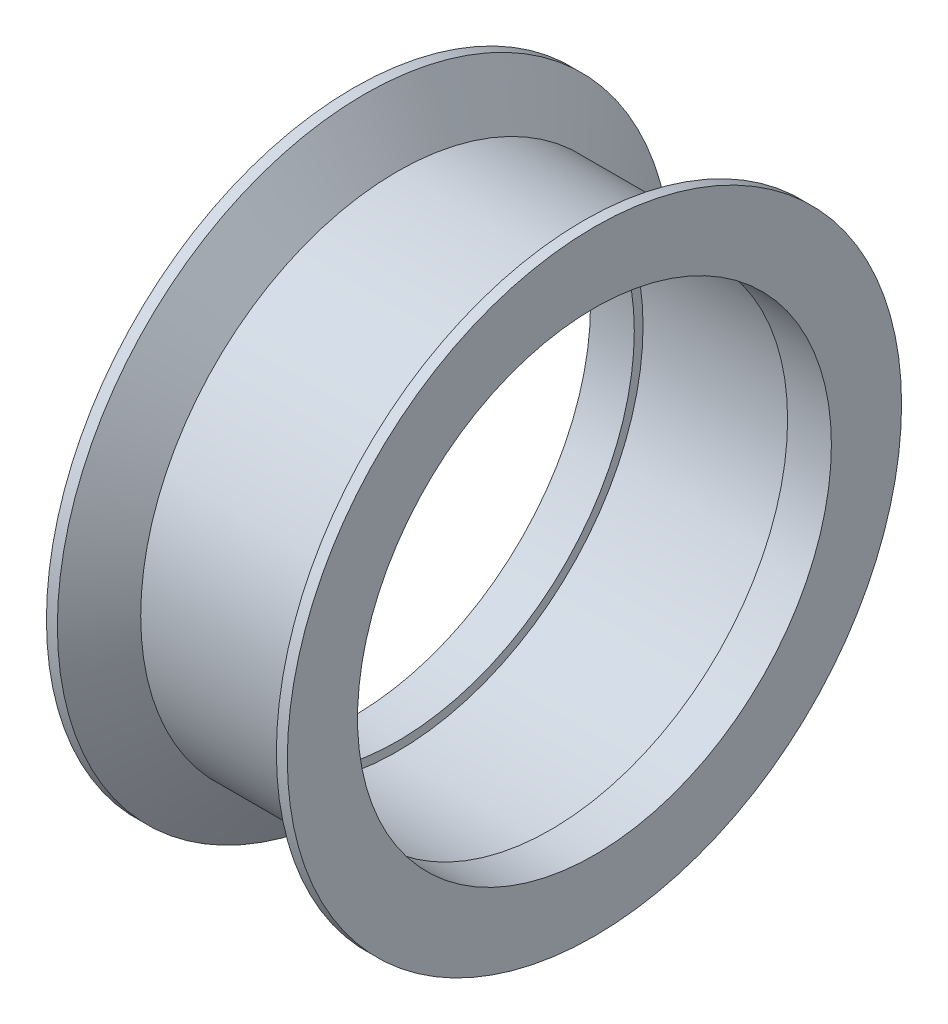
ISO-10303-21;
HEADER;
FILE_DESCRIPTION(('STEP AP214'),'2;1');
FILE_NAME('part.step','',(''),(''),'','','');
FILE_SCHEMA(('AUTOMOTIVE_DESIGN { 1 0 10303 214 1 1 1 1 }'));
ENDSEC;
DATA;
#1=APPLICATION_CONTEXT('core data for automotive mechanical design processes');
#2=APPLICATION_PROTOCOL_DEFINITION('international standard','automotive_design',2000,#1);
#3=PRODUCT_CONTEXT('',#1,'mechanical');
#4=PRODUCT('Part','Part','',(#3));
#5=PRODUCT_RELATED_PRODUCT_CATEGORY('part','',(#4));
#6=PRODUCT_DEFINITION_FORMATION('','',#4);
#7=PRODUCT_DEFINITION_CONTEXT('part definition',#1,'design');
#8=PRODUCT_DEFINITION('design','',#6,#7);
#9=PRODUCT_DEFINITION_SHAPE('','',#8);
#10=(LENGTH_UNIT() NAMED_UNIT(*) SI_UNIT(.MILLI.,.METRE.));
#11=(NAMED_UNIT(*) PLANE_ANGLE_UNIT() SI_UNIT($,.RADIAN.));
#12=(NAMED_UNIT(*) SI_UNIT($,.STERADIAN.) SOLID_ANGLE_UNIT());
#13=UNCERTAINTY_MEASURE_WITH_UNIT(LENGTH_MEASURE(1.E-05),#10,'distance_accuracy_value','');
#14=(GEOMETRIC_REPRESENTATION_CONTEXT(3) GLOBAL_UNCERTAINTY_ASSIGNED_CONTEXT((#13)) GLOBAL_UNIT_ASSIGNED_CONTEXT((#10,
#11,#12)) REPRESENTATION_CONTEXT('',''));
#15=CARTESIAN_POINT('',(0.,0.,0.));
#16=DIRECTION('',(0.,0.,1.));
#17=DIRECTION('',(1.,0.,0.));
#18=AXIS2_PLACEMENT_3D('',#15,#16,#17);
#19=CARTESIAN_POINT('',(5.5,10.82,0.));
#20=DIRECTION('',(1.,0.,0.));
#21=DIRECTION('',(0.,0.,-1.));
#22=AXIS2_PLACEMENT_3D('',#19,#20,#21);
#23=PLANE('',#22);
#24=CARTESIAN_POINT('',(5.5,0.,0.));
#25=DIRECTION('',(1.,0.,0.));
#26=DIRECTION('',(0.,0.,-1.));
#27=AXIS2_PLACEMENT_3D('',#24,#25,#26);
#28=CIRCLE('',#27,14.0248861143232);
#29=CARTESIAN_POINT('',(5.5,0.,-14.0248861143232));
#30=VERTEX_POINT('',#29);
#31=EDGE_CURVE('E10',#30,#30,#28,.T.);
#32=ORIENTED_EDGE('',*,*,#31,.T.);
#33=EDGE_LOOP('',(#32));
#34=FACE_BOUND('',#33,.T.);
#35=CARTESIAN_POINT('',(5.5,0.,0.));
#36=DIRECTION('',(1.,0.,0.));
#37=DIRECTION('',(0.,0.,-1.));
#38=AXIS2_PLACEMENT_3D('',#35,#36,#37);
#39=CIRCLE('',#38,10.82);
#40=CARTESIAN_POINT('',(5.5,0.,-10.82));
#41=VERTEX_POINT('',#40);
#42=EDGE_CURVE('E70',#41,#41,#39,.T.);
#43=ORIENTED_EDGE('',*,*,#42,.F.);
#44=EDGE_LOOP('',(#43));
#45=FACE_BOUND('',#44,.T.);
#46=ADVANCED_FACE('F30',(#34,#45),#23,.T.);
#47=CARTESIAN_POINT('',(0.,0.,0.));
#48=DIRECTION('',(1.,0.,0.));
#49=DIRECTION('',(0.,0.,-1.));
#50=AXIS2_PLACEMENT_3D('',#47,#48,#49);
#51=CYLINDRICAL_SURFACE('',#50,14.0248861143232);
#52=CARTESIAN_POINT('',(5.,0.,0.));
#53=DIRECTION('',(1.,0.,0.));
#54=DIRECTION('',(0.,0.,-1.));
#55=AXIS2_PLACEMENT_3D('',#52,#53,#54);
#56=CIRCLE('',#55,14.0248861143232);
#57=CARTESIAN_POINT('',(5.,0.,-14.0248861143232));
#58=VERTEX_POINT('',#57);
#59=EDGE_CURVE('E36',#58,#58,#56,.T.);
#60=ORIENTED_EDGE('',*,*,#59,.T.);
#61=EDGE_LOOP('',(#60));
#62=FACE_BOUND('',#61,.T.);
#63=ORIENTED_EDGE('',*,*,#31,.F.);
#64=EDGE_LOOP('',(#63));
#65=FACE_BOUND('',#64,.T.);
#66=ADVANCED_FACE('F78',(#62,#65),#51,.T.);
#67=CARTESIAN_POINT('',(5.,0.,0.));
#68=DIRECTION('',(1.,0.,0.));
#69=DIRECTION('',(0.,0.,-1.));
#70=AXIS2_PLACEMENT_3D('',#67,#68,#69);
#71=CONICAL_SURFACE('',#70,14.0248861143232,0.99386498155844);
#72=CARTESIAN_POINT('',(3.5,0.,0.));
#73=DIRECTION('',(1.,0.,0.));
#74=DIRECTION('',(0.,0.,-1.));
#75=AXIS2_PLACEMENT_3D('',#72,#73,#74);
#76=CIRCLE('',#75,11.72);
#77=CARTESIAN_POINT('',(3.5,0.,-11.72));
#78=VERTEX_POINT('',#77);
#79=EDGE_CURVE('E40',#78,#78,#76,.T.);
#80=ORIENTED_EDGE('',*,*,#79,.T.);
#81=EDGE_LOOP('',(#80));
#82=FACE_BOUND('',#81,.T.);
#83=ORIENTED_EDGE('',*,*,#59,.F.);
#84=EDGE_LOOP('',(#83));
#85=FACE_BOUND('',#84,.T.);
#86=ADVANCED_FACE('F82',(#82,#85),#71,.T.);
#87=CARTESIAN_POINT('',(0.,0.,0.));
#88=DIRECTION('',(1.,0.,0.));
#89=DIRECTION('',(0.,0.,-1.));
#90=AXIS2_PLACEMENT_3D('',#87,#88,#89);
#91=CYLINDRICAL_SURFACE('',#90,11.72);
#92=CARTESIAN_POINT('',(-3.5,0.,0.));
#93=DIRECTION('',(1.,0.,0.));
#94=DIRECTION('',(0.,0.,-1.));
#95=AXIS2_PLACEMENT_3D('',#92,#93,#94);
#96=CIRCLE('',#95,11.72);
#97=CARTESIAN_POINT('',(-3.5,0.,-11.72));
#98=VERTEX_POINT('',#97);
#99=EDGE_CURVE('E44',#98,#98,#96,.T.);
#100=ORIENTED_EDGE('',*,*,#99,.T.);
#101=EDGE_LOOP('',(#100));
#102=FACE_BOUND('',#101,.T.);
#103=ORIENTED_EDGE('',*,*,#79,.F.);
#104=EDGE_LOOP('',(#103));
#105=FACE_BOUND('',#104,.T.);
#106=ADVANCED_FACE('F86',(#102,#105),#91,.T.);
#107=CARTESIAN_POINT('',(-3.5,0.,0.));
#108=DIRECTION('',(-1.,0.,0.));
#109=DIRECTION('',(0.,0.,1.));
#110=AXIS2_PLACEMENT_3D('',#107,#108,#109);
#111=CONICAL_SURFACE('',#110,11.72,0.993864981558441);
#112=CARTESIAN_POINT('',(-5.,0.,0.));
#113=DIRECTION('',(1.,0.,0.));
#114=DIRECTION('',(0.,0.,-1.));
#115=AXIS2_PLACEMENT_3D('',#112,#113,#114);
#116=CIRCLE('',#115,14.0248861143232);
#117=CARTESIAN_POINT('',(-5.,0.,-14.0248861143232));
#118=VERTEX_POINT('',#117);
#119=EDGE_CURVE('E49',#118,#118,#116,.T.);
#120=ORIENTED_EDGE('',*,*,#119,.T.);
#121=EDGE_LOOP('',(#120));
#122=FACE_BOUND('',#121,.T.);
#123=ORIENTED_EDGE('',*,*,#99,.F.);
#124=EDGE_LOOP('',(#123));
#125=FACE_BOUND('',#124,.T.);
#126=ADVANCED_FACE('F93',(#122,#125),#111,.T.);
#127=CARTESIAN_POINT('',(0.,0.,0.));
#128=DIRECTION('',(1.,0.,0.));
#129=DIRECTION('',(0.,0.,-1.));
#130=AXIS2_PLACEMENT_3D('',#127,#128,#129);
#131=CYLINDRICAL_SURFACE('',#130,14.0248861143232);
#132=CARTESIAN_POINT('',(-5.5,0.,0.));
#133=DIRECTION('',(1.,0.,0.));
#134=DIRECTION('',(0.,0.,-1.));
#135=AXIS2_PLACEMENT_3D('',#132,#133,#134);
#136=CIRCLE('',#135,14.0248861143232);
#137=CARTESIAN_POINT('',(-5.5,0.,-14.0248861143232));
#138=VERTEX_POINT('',#137);
#139=EDGE_CURVE('E52',#138,#138,#136,.T.);
#140=ORIENTED_EDGE('',*,*,#139,.T.);
#141=EDGE_LOOP('',(#140));
#142=FACE_BOUND('',#141,.T.);
#143=ORIENTED_EDGE('',*,*,#119,.F.);
#144=EDGE_LOOP('',(#143));
#145=FACE_BOUND('',#144,.T.);
#146=ADVANCED_FACE('F97',(#142,#145),#131,.T.);
#147=CARTESIAN_POINT('',(-5.5,10.82,0.));
#148=DIRECTION('',(-1.,0.,0.));
#149=DIRECTION('',(0.,0.,1.));
#150=AXIS2_PLACEMENT_3D('',#147,#148,#149);
#151=PLANE('',#150);
#152=CARTESIAN_POINT('',(-5.5,0.,0.));
#153=DIRECTION('',(1.,0.,0.));
#154=DIRECTION('',(0.,0.,-1.));
#155=AXIS2_PLACEMENT_3D('',#152,#153,#154);
#156=CIRCLE('',#155,10.82);
#157=CARTESIAN_POINT('',(-5.5,0.,-10.82));
#158=VERTEX_POINT('',#157);
#159=EDGE_CURVE('E55',#158,#158,#156,.T.);
#160=ORIENTED_EDGE('',*,*,#159,.T.);
#161=EDGE_LOOP('',(#160));
#162=FACE_BOUND('',#161,.T.);
#163=ORIENTED_EDGE('',*,*,#139,.F.);
#164=EDGE_LOOP('',(#163));
#165=FACE_BOUND('',#164,.T.);
#166=ADVANCED_FACE('F101',(#162,#165),#151,.T.);
#167=CARTESIAN_POINT('',(0.,0.,0.));
#168=DIRECTION('',(1.,0.,0.));
#169=DIRECTION('',(0.,0.,-1.));
#170=AXIS2_PLACEMENT_3D('',#167,#168,#169);
#171=CYLINDRICAL_SURFACE('',#170,10.82);
#172=CARTESIAN_POINT('',(-3.5,0.,0.));
#173=DIRECTION('',(1.,0.,0.));
#174=DIRECTION('',(0.,0.,-1.));
#175=AXIS2_PLACEMENT_3D('',#172,#173,#174);
#176=CIRCLE('',#175,10.82);
#177=CARTESIAN_POINT('',(-3.5,0.,-10.82));
#178=VERTEX_POINT('',#177);
#179=EDGE_CURVE('E58',#178,#178,#176,.T.);
#180=ORIENTED_EDGE('',*,*,#179,.T.);
#181=EDGE_LOOP('',(#180));
#182=FACE_BOUND('',#181,.T.);
#183=ORIENTED_EDGE('',*,*,#159,.F.);
#184=EDGE_LOOP('',(#183));
#185=FACE_BOUND('',#184,.T.);
#186=ADVANCED_FACE('F105',(#182,#185),#171,.F.);
#187=CARTESIAN_POINT('',(-3.5,10.82,0.));
#188=DIRECTION('',(1.,0.,0.));
#189=DIRECTION('',(0.,0.,-1.));
#190=AXIS2_PLACEMENT_3D('',#187,#188,#189);
#191=PLANE('',#190);
#192=CARTESIAN_POINT('',(-3.5,0.,0.));
#193=DIRECTION('',(1.,0.,0.));
#194=DIRECTION('',(0.,0.,-1.));
#195=AXIS2_PLACEMENT_3D('',#192,#193,#194);
#196=CIRCLE('',#195,11.22);
#197=CARTESIAN_POINT('',(-3.5,0.,-11.22));
#198=VERTEX_POINT('',#197);
#199=EDGE_CURVE('E61',#198,#198,#196,.T.);
#200=ORIENTED_EDGE('',*,*,#199,.T.);
#201=EDGE_LOOP('',(#200));
#202=FACE_BOUND('',#201,.T.);
#203=ORIENTED_EDGE('',*,*,#179,.F.);
#204=EDGE_LOOP('',(#203));
#205=FACE_BOUND('',#204,.T.);
#206=ADVANCED_FACE('F109',(#202,#205),#191,.T.);
#207=CARTESIAN_POINT('',(0.,0.,0.));
#208=DIRECTION('',(1.,0.,0.));
#209=DIRECTION('',(0.,0.,-1.));
#210=AXIS2_PLACEMENT_3D('',#207,#208,#209);
#211=CYLINDRICAL_SURFACE('',#210,11.22);
#212=CARTESIAN_POINT('',(3.5,0.,0.));
#213=DIRECTION('',(1.,0.,0.));
#214=DIRECTION('',(0.,0.,-1.));
#215=AXIS2_PLACEMENT_3D('',#212,#213,#214);
#216=CIRCLE('',#215,11.22);
#217=CARTESIAN_POINT('',(3.5,0.,-11.22));
#218=VERTEX_POINT('',#217);
#219=EDGE_CURVE('E64',#218,#218,#216,.T.);
#220=ORIENTED_EDGE('',*,*,#219,.T.);
#221=EDGE_LOOP('',(#220));
#222=FACE_BOUND('',#221,.T.);
#223=ORIENTED_EDGE('',*,*,#199,.F.);
#224=EDGE_LOOP('',(#223));
#225=FACE_BOUND('',#224,.T.);
#226=ADVANCED_FACE('F113',(#222,#225),#211,.F.);
#227=CARTESIAN_POINT('',(3.5,10.82,0.));
#228=DIRECTION('',(-1.,0.,0.));
#229=DIRECTION('',(0.,0.,1.));
#230=AXIS2_PLACEMENT_3D('',#227,#228,#229);
#231=PLANE('',#230);
#232=CARTESIAN_POINT('',(3.5,0.,0.));
#233=DIRECTION('',(1.,0.,0.));
#234=DIRECTION('',(0.,0.,-1.));
#235=AXIS2_PLACEMENT_3D('',#232,#233,#234);
#236=CIRCLE('',#235,10.82);
#237=CARTESIAN_POINT('',(3.5,0.,-10.82));
#238=VERTEX_POINT('',#237);
#239=EDGE_CURVE('E67',#238,#238,#236,.T.);
#240=ORIENTED_EDGE('',*,*,#239,.T.);
#241=EDGE_LOOP('',(#240));
#242=FACE_BOUND('',#241,.T.);
#243=ORIENTED_EDGE('',*,*,#219,.F.);
#244=EDGE_LOOP('',(#243));
#245=FACE_BOUND('',#244,.T.);
#246=ADVANCED_FACE('F117',(#242,#245),#231,.T.);
#247=CARTESIAN_POINT('',(0.,0.,0.));
#248=DIRECTION('',(1.,0.,0.));
#249=DIRECTION('',(0.,0.,-1.));
#250=AXIS2_PLACEMENT_3D('',#247,#248,#249);
#251=CYLINDRICAL_SURFACE('',#250,10.82);
#252=ORIENTED_EDGE('',*,*,#42,.T.);
#253=EDGE_LOOP('',(#252));
#254=FACE_BOUND('',#253,.T.);
#255=ORIENTED_EDGE('',*,*,#239,.F.);
#256=EDGE_LOOP('',(#255));
#257=FACE_BOUND('',#256,.T.);
#258=ADVANCED_FACE('F74',(#254,#257),#251,.F.);
#259=CLOSED_SHELL('',(#46,#66,#86,#106,#126,#146,#166,#186,#206,#226,#246,#258));
#260=MANIFOLD_SOLID_BREP('B2',#259);
#261=ADVANCED_BREP_SHAPE_REPRESENTATION('',(#18,#260),#14);
#262=SHAPE_DEFINITION_REPRESENTATION(#9,#261);
ENDSEC;
END-ISO-10303-21;
